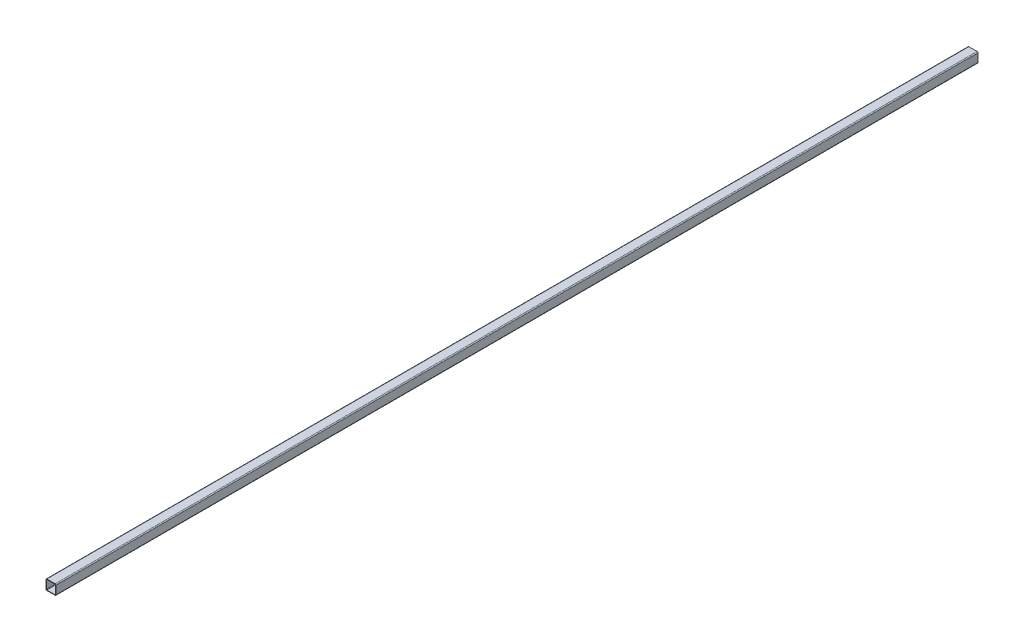
ISO-10303-21;
HEADER;
FILE_DESCRIPTION(('STEP AP214'),'2;1');
FILE_NAME('part.step','',(''),(''),'','','');
FILE_SCHEMA(('AUTOMOTIVE_DESIGN { 1 0 10303 214 1 1 1 1 }'));
ENDSEC;
DATA;
#1=APPLICATION_CONTEXT('core data for automotive mechanical design processes');
#2=APPLICATION_PROTOCOL_DEFINITION('international standard','automotive_design',2000,#1);
#3=PRODUCT_CONTEXT('',#1,'mechanical');
#4=PRODUCT('Part','Part','',(#3));
#5=PRODUCT_RELATED_PRODUCT_CATEGORY('part','',(#4));
#6=PRODUCT_DEFINITION_FORMATION('','',#4);
#7=PRODUCT_DEFINITION_CONTEXT('part definition',#1,'design');
#8=PRODUCT_DEFINITION('design','',#6,#7);
#9=PRODUCT_DEFINITION_SHAPE('','',#8);
#10=(LENGTH_UNIT() NAMED_UNIT(*) SI_UNIT(.MILLI.,.METRE.));
#11=(NAMED_UNIT(*) PLANE_ANGLE_UNIT() SI_UNIT($,.RADIAN.));
#12=(NAMED_UNIT(*) SI_UNIT($,.STERADIAN.) SOLID_ANGLE_UNIT());
#13=UNCERTAINTY_MEASURE_WITH_UNIT(LENGTH_MEASURE(1.E-05),#10,'distance_accuracy_value','');
#14=(GEOMETRIC_REPRESENTATION_CONTEXT(3) GLOBAL_UNCERTAINTY_ASSIGNED_CONTEXT((#13)) GLOBAL_UNIT_ASSIGNED_CONTEXT((#10,
#11,#12)) REPRESENTATION_CONTEXT('',''));
#15=CARTESIAN_POINT('',(0.,0.,0.));
#16=DIRECTION('',(0.,0.,1.));
#17=DIRECTION('',(1.,0.,0.));
#18=AXIS2_PLACEMENT_3D('',#15,#16,#17);
#19=CARTESIAN_POINT('',(-11.2903,-11.2903,1270.));
#20=DIRECTION('',(0.,0.,1.));
#21=DIRECTION('',(1.,0.,0.));
#22=AXIS2_PLACEMENT_3D('',#19,#20,#21);
#23=PLANE('',#22);
#24=CARTESIAN_POINT('',(-11.2903,-11.2903,1270.));
#25=DIRECTION('',(0.,0.,1.));
#26=DIRECTION('',(1.,0.,0.));
#27=AXIS2_PLACEMENT_3D('',#24,#25,#26);
#28=CIRCLE('',#27,2.54);
#29=CARTESIAN_POINT('',(-13.8303,-11.2903,1270.));
#30=VERTEX_POINT('',#29);
#31=CARTESIAN_POINT('',(-11.2903,-13.8303,1270.));
#32=VERTEX_POINT('',#31);
#33=EDGE_CURVE('E211',#30,#32,#28,.T.);
#34=ORIENTED_EDGE('',*,*,#33,.T.);
#35=DIRECTION('',(1.,0.,0.));
#36=VECTOR('',#35,1.);
#37=CARTESIAN_POINT('',(-11.2903,-13.8303,1270.));
#38=LINE('',#37,#36);
#39=CARTESIAN_POINT('',(11.2903,-13.8303,1270.));
#40=VERTEX_POINT('',#39);
#41=EDGE_CURVE('E214',#32,#40,#38,.T.);
#42=ORIENTED_EDGE('',*,*,#41,.T.);
#43=CARTESIAN_POINT('',(11.2903,-11.2903,1270.));
#44=DIRECTION('',(0.,0.,1.));
#45=DIRECTION('',(1.,0.,0.));
#46=AXIS2_PLACEMENT_3D('',#43,#44,#45);
#47=CIRCLE('',#46,2.53999999999999);
#48=CARTESIAN_POINT('',(13.8303,-11.2903,1270.));
#49=VERTEX_POINT('',#48);
#50=EDGE_CURVE('E217',#40,#49,#47,.T.);
#51=ORIENTED_EDGE('',*,*,#50,.T.);
#52=DIRECTION('',(0.,1.,0.));
#53=VECTOR('',#52,1.);
#54=CARTESIAN_POINT('',(13.8303,11.2903,1270.));
#55=LINE('',#54,#53);
#56=CARTESIAN_POINT('',(13.8303,11.2903,1270.));
#57=VERTEX_POINT('',#56);
#58=EDGE_CURVE('E219',#49,#57,#55,.T.);
#59=ORIENTED_EDGE('',*,*,#58,.T.);
#60=CARTESIAN_POINT('',(11.2903,11.2903,1270.));
#61=DIRECTION('',(0.,0.,1.));
#62=DIRECTION('',(-1.,0.,0.));
#63=AXIS2_PLACEMENT_3D('',#60,#61,#62);
#64=CIRCLE('',#63,2.53999999999999);
#65=CARTESIAN_POINT('',(11.2903,13.8303,1270.));
#66=VERTEX_POINT('',#65);
#67=EDGE_CURVE('E221',#57,#66,#64,.T.);
#68=ORIENTED_EDGE('',*,*,#67,.T.);
#69=DIRECTION('',(-1.,0.,0.));
#70=VECTOR('',#69,1.);
#71=CARTESIAN_POINT('',(-11.2903,13.8303,1270.));
#72=LINE('',#71,#70);
#73=CARTESIAN_POINT('',(-11.2903,13.8303,1270.));
#74=VERTEX_POINT('',#73);
#75=EDGE_CURVE('E223',#66,#74,#72,.T.);
#76=ORIENTED_EDGE('',*,*,#75,.T.);
#77=CARTESIAN_POINT('',(-11.2903,11.2903,1270.));
#78=DIRECTION('',(0.,0.,1.));
#79=DIRECTION('',(1.,0.,0.));
#80=AXIS2_PLACEMENT_3D('',#77,#78,#79);
#81=CIRCLE('',#80,2.54);
#82=CARTESIAN_POINT('',(-13.8303,11.2903,1270.));
#83=VERTEX_POINT('',#82);
#84=EDGE_CURVE('E225',#74,#83,#81,.T.);
#85=ORIENTED_EDGE('',*,*,#84,.T.);
#86=DIRECTION('',(0.,-1.,0.));
#87=VECTOR('',#86,1.);
#88=CARTESIAN_POINT('',(-13.8303,11.2903,1270.));
#89=LINE('',#88,#87);
#90=EDGE_CURVE('E227',#83,#30,#89,.T.);
#91=ORIENTED_EDGE('',*,*,#90,.T.);
#92=EDGE_LOOP('',(#34,#42,#51,#59,#68,#76,#85,#91));
#93=FACE_BOUND('',#92,.T.);
#94=DIRECTION('',(0.,-1.,0.));
#95=VECTOR('',#94,1.);
#96=CARTESIAN_POINT('',(-12.5603,11.2903,1270.));
#97=LINE('',#96,#95);
#98=CARTESIAN_POINT('',(-12.5603,11.2903,1270.));
#99=VERTEX_POINT('',#98);
#100=CARTESIAN_POINT('',(-12.5603,-11.2903,1270.));
#101=VERTEX_POINT('',#100);
#102=EDGE_CURVE('E154',#99,#101,#97,.T.);
#103=ORIENTED_EDGE('',*,*,#102,.F.);
#104=CARTESIAN_POINT('',(-11.2903,11.2903,1270.));
#105=DIRECTION('',(0.,0.,1.));
#106=DIRECTION('',(1.,0.,0.));
#107=AXIS2_PLACEMENT_3D('',#104,#105,#106);
#108=CIRCLE('',#107,1.27);
#109=CARTESIAN_POINT('',(-11.2903,12.5603,1270.));
#110=VERTEX_POINT('',#109);
#111=EDGE_CURVE('E146',#110,#99,#108,.T.);
#112=ORIENTED_EDGE('',*,*,#111,.F.);
#113=DIRECTION('',(-1.,0.,0.));
#114=VECTOR('',#113,1.);
#115=CARTESIAN_POINT('',(-11.2903,12.5603,1270.));
#116=LINE('',#115,#114);
#117=CARTESIAN_POINT('',(11.2903,12.5603,1270.));
#118=VERTEX_POINT('',#117);
#119=EDGE_CURVE('E179',#118,#110,#116,.T.);
#120=ORIENTED_EDGE('',*,*,#119,.F.);
#121=CARTESIAN_POINT('',(11.2903,11.2903,1270.));
#122=DIRECTION('',(0.,0.,1.));
#123=DIRECTION('',(-1.,0.,0.));
#124=AXIS2_PLACEMENT_3D('',#121,#122,#123);
#125=CIRCLE('',#124,1.26999999999999);
#126=CARTESIAN_POINT('',(12.5603,11.2903,1270.));
#127=VERTEX_POINT('',#126);
#128=EDGE_CURVE('E177',#127,#118,#125,.T.);
#129=ORIENTED_EDGE('',*,*,#128,.F.);
#130=DIRECTION('',(0.,1.,0.));
#131=VECTOR('',#130,1.);
#132=CARTESIAN_POINT('',(12.5603,11.2903,1270.));
#133=LINE('',#132,#131);
#134=CARTESIAN_POINT('',(12.5603,-11.2903,1270.));
#135=VERTEX_POINT('',#134);
#136=EDGE_CURVE('E175',#135,#127,#133,.T.);
#137=ORIENTED_EDGE('',*,*,#136,.F.);
#138=CARTESIAN_POINT('',(11.2903,-11.2903,1270.));
#139=DIRECTION('',(0.,0.,1.));
#140=DIRECTION('',(1.,0.,0.));
#141=AXIS2_PLACEMENT_3D('',#138,#139,#140);
#142=CIRCLE('',#141,1.27);
#143=CARTESIAN_POINT('',(11.2903,-12.5603,1270.));
#144=VERTEX_POINT('',#143);
#145=EDGE_CURVE('E173',#144,#135,#142,.T.);
#146=ORIENTED_EDGE('',*,*,#145,.F.);
#147=DIRECTION('',(1.,0.,0.));
#148=VECTOR('',#147,1.);
#149=CARTESIAN_POINT('',(-11.2903,-12.5603,1270.));
#150=LINE('',#149,#148);
#151=CARTESIAN_POINT('',(-11.2903,-12.5603,1270.));
#152=VERTEX_POINT('',#151);
#153=EDGE_CURVE('E169',#152,#144,#150,.T.);
#154=ORIENTED_EDGE('',*,*,#153,.F.);
#155=CARTESIAN_POINT('',(-11.2903,-11.2903,1270.));
#156=DIRECTION('',(0.,0.,1.));
#157=DIRECTION('',(1.,0.,0.));
#158=AXIS2_PLACEMENT_3D('',#155,#156,#157);
#159=CIRCLE('',#158,1.27);
#160=EDGE_CURVE('E167',#101,#152,#159,.T.);
#161=ORIENTED_EDGE('',*,*,#160,.F.);
#162=EDGE_LOOP('',(#103,#112,#120,#129,#137,#146,#154,#161));
#163=FACE_BOUND('',#162,.T.);
#164=ADVANCED_FACE('F33',(#93,#163),#23,.T.);
#165=CARTESIAN_POINT('',(-11.2903,-11.2903,-1270.));
#166=DIRECTION('',(0.,0.,1.));
#167=DIRECTION('',(1.,0.,0.));
#168=AXIS2_PLACEMENT_3D('',#165,#166,#167);
#169=PLANE('',#168);
#170=CARTESIAN_POINT('',(-11.2903,-11.2903,-1270.));
#171=DIRECTION('',(0.,0.,1.));
#172=DIRECTION('',(1.,0.,0.));
#173=AXIS2_PLACEMENT_3D('',#170,#171,#172);
#174=CIRCLE('',#173,2.54);
#175=CARTESIAN_POINT('',(-13.8303,-11.2903,-1270.));
#176=VERTEX_POINT('',#175);
#177=CARTESIAN_POINT('',(-11.2903,-13.8303,-1270.));
#178=VERTEX_POINT('',#177);
#179=EDGE_CURVE('E162',#176,#178,#174,.T.);
#180=ORIENTED_EDGE('',*,*,#179,.F.);
#181=DIRECTION('',(0.,-1.,0.));
#182=VECTOR('',#181,1.);
#183=CARTESIAN_POINT('',(-13.8303,11.2903,-1270.));
#184=LINE('',#183,#182);
#185=CARTESIAN_POINT('',(-13.8303,11.2903,-1270.));
#186=VERTEX_POINT('',#185);
#187=EDGE_CURVE('E215',#186,#176,#184,.T.);
#188=ORIENTED_EDGE('',*,*,#187,.F.);
#189=CARTESIAN_POINT('',(-11.2903,11.2903,-1270.));
#190=DIRECTION('',(0.,0.,1.));
#191=DIRECTION('',(1.,0.,0.));
#192=AXIS2_PLACEMENT_3D('',#189,#190,#191);
#193=CIRCLE('',#192,2.54);
#194=CARTESIAN_POINT('',(-11.2903,13.8303,-1270.));
#195=VERTEX_POINT('',#194);
#196=EDGE_CURVE('E242',#195,#186,#193,.T.);
#197=ORIENTED_EDGE('',*,*,#196,.F.);
#198=DIRECTION('',(-1.,0.,0.));
#199=VECTOR('',#198,1.);
#200=CARTESIAN_POINT('',(-11.2903,13.8303,-1270.));
#201=LINE('',#200,#199);
#202=CARTESIAN_POINT('',(11.2903,13.8303,-1270.));
#203=VERTEX_POINT('',#202);
#204=EDGE_CURVE('E240',#203,#195,#201,.T.);
#205=ORIENTED_EDGE('',*,*,#204,.F.);
#206=CARTESIAN_POINT('',(11.2903,11.2903,-1270.));
#207=DIRECTION('',(0.,0.,1.));
#208=DIRECTION('',(-1.,0.,0.));
#209=AXIS2_PLACEMENT_3D('',#206,#207,#208);
#210=CIRCLE('',#209,2.53999999999999);
#211=CARTESIAN_POINT('',(13.8303,11.2903,-1270.));
#212=VERTEX_POINT('',#211);
#213=EDGE_CURVE('E238',#212,#203,#210,.T.);
#214=ORIENTED_EDGE('',*,*,#213,.F.);
#215=DIRECTION('',(0.,1.,0.));
#216=VECTOR('',#215,1.);
#217=CARTESIAN_POINT('',(13.8303,11.2903,-1270.));
#218=LINE('',#217,#216);
#219=CARTESIAN_POINT('',(13.8303,-11.2903,-1270.));
#220=VERTEX_POINT('',#219);
#221=EDGE_CURVE('E236',#220,#212,#218,.T.);
#222=ORIENTED_EDGE('',*,*,#221,.F.);
#223=CARTESIAN_POINT('',(11.2903,-11.2903,-1270.));
#224=DIRECTION('',(0.,0.,1.));
#225=DIRECTION('',(1.,0.,0.));
#226=AXIS2_PLACEMENT_3D('',#223,#224,#225);
#227=CIRCLE('',#226,2.53999999999999);
#228=CARTESIAN_POINT('',(11.2903,-13.8303,-1270.));
#229=VERTEX_POINT('',#228);
#230=EDGE_CURVE('E234',#229,#220,#227,.T.);
#231=ORIENTED_EDGE('',*,*,#230,.F.);
#232=DIRECTION('',(1.,0.,0.));
#233=VECTOR('',#232,1.);
#234=CARTESIAN_POINT('',(-11.2903,-13.8303,-1270.));
#235=LINE('',#234,#233);
#236=EDGE_CURVE('E232',#178,#229,#235,.T.);
#237=ORIENTED_EDGE('',*,*,#236,.F.);
#238=EDGE_LOOP('',(#180,#188,#197,#205,#214,#222,#231,#237));
#239=FACE_BOUND('',#238,.T.);
#240=CARTESIAN_POINT('',(-11.2903,11.2903,-1270.));
#241=DIRECTION('',(0.,0.,1.));
#242=DIRECTION('',(1.,0.,0.));
#243=AXIS2_PLACEMENT_3D('',#240,#241,#242);
#244=CIRCLE('',#243,1.27);
#245=CARTESIAN_POINT('',(-11.2903,12.5603,-1270.));
#246=VERTEX_POINT('',#245);
#247=CARTESIAN_POINT('',(-12.5603,11.2903,-1270.));
#248=VERTEX_POINT('',#247);
#249=EDGE_CURVE('E56',#246,#248,#244,.T.);
#250=ORIENTED_EDGE('',*,*,#249,.T.);
#251=DIRECTION('',(0.,-1.,0.));
#252=VECTOR('',#251,1.);
#253=CARTESIAN_POINT('',(-12.5603,11.2903,-1270.));
#254=LINE('',#253,#252);
#255=CARTESIAN_POINT('',(-12.5603,-11.2903,-1270.));
#256=VERTEX_POINT('',#255);
#257=EDGE_CURVE('E161',#248,#256,#254,.T.);
#258=ORIENTED_EDGE('',*,*,#257,.T.);
#259=CARTESIAN_POINT('',(-11.2903,-11.2903,-1270.));
#260=DIRECTION('',(0.,0.,1.));
#261=DIRECTION('',(1.,0.,0.));
#262=AXIS2_PLACEMENT_3D('',#259,#260,#261);
#263=CIRCLE('',#262,1.27);
#264=CARTESIAN_POINT('',(-11.2903,-12.5603,-1270.));
#265=VERTEX_POINT('',#264);
#266=EDGE_CURVE('E183',#256,#265,#263,.T.);
#267=ORIENTED_EDGE('',*,*,#266,.T.);
#268=DIRECTION('',(1.,0.,0.));
#269=VECTOR('',#268,1.);
#270=CARTESIAN_POINT('',(-11.2903,-12.5603,-1270.));
#271=LINE('',#270,#269);
#272=CARTESIAN_POINT('',(11.2903,-12.5603,-1270.));
#273=VERTEX_POINT('',#272);
#274=EDGE_CURVE('E186',#265,#273,#271,.T.);
#275=ORIENTED_EDGE('',*,*,#274,.T.);
#276=CARTESIAN_POINT('',(11.2903,-11.2903,-1270.));
#277=DIRECTION('',(0.,0.,1.));
#278=DIRECTION('',(1.,0.,0.));
#279=AXIS2_PLACEMENT_3D('',#276,#277,#278);
#280=CIRCLE('',#279,1.27);
#281=CARTESIAN_POINT('',(12.5603,-11.2903,-1270.));
#282=VERTEX_POINT('',#281);
#283=EDGE_CURVE('E189',#273,#282,#280,.T.);
#284=ORIENTED_EDGE('',*,*,#283,.T.);
#285=DIRECTION('',(0.,1.,0.));
#286=VECTOR('',#285,1.);
#287=CARTESIAN_POINT('',(12.5603,11.2903,-1270.));
#288=LINE('',#287,#286);
#289=CARTESIAN_POINT('',(12.5603,11.2903,-1270.));
#290=VERTEX_POINT('',#289);
#291=EDGE_CURVE('E192',#282,#290,#288,.T.);
#292=ORIENTED_EDGE('',*,*,#291,.T.);
#293=CARTESIAN_POINT('',(11.2903,11.2903,-1270.));
#294=DIRECTION('',(0.,0.,1.));
#295=DIRECTION('',(-1.,0.,0.));
#296=AXIS2_PLACEMENT_3D('',#293,#294,#295);
#297=CIRCLE('',#296,1.26999999999999);
#298=CARTESIAN_POINT('',(11.2903,12.5603,-1270.));
#299=VERTEX_POINT('',#298);
#300=EDGE_CURVE('E195',#290,#299,#297,.T.);
#301=ORIENTED_EDGE('',*,*,#300,.T.);
#302=DIRECTION('',(-1.,0.,0.));
#303=VECTOR('',#302,1.);
#304=CARTESIAN_POINT('',(-11.2903,12.5603,-1270.));
#305=LINE('',#304,#303);
#306=EDGE_CURVE('E155',#299,#246,#305,.T.);
#307=ORIENTED_EDGE('',*,*,#306,.T.);
#308=EDGE_LOOP('',(#250,#258,#267,#275,#284,#292,#301,#307));
#309=FACE_BOUND('',#308,.T.);
#310=ADVANCED_FACE('F272',(#239,#309),#169,.F.);
#311=CARTESIAN_POINT('',(-11.2903,-11.2903,1270.));
#312=DIRECTION('',(0.,0.,-1.));
#313=DIRECTION('',(-1.,0.,0.));
#314=AXIS2_PLACEMENT_3D('',#311,#312,#313);
#315=CYLINDRICAL_SURFACE('',#314,2.54);
#316=ORIENTED_EDGE('',*,*,#179,.T.);
#317=DIRECTION('',(0.,0.,-1.));
#318=VECTOR('',#317,1.);
#319=CARTESIAN_POINT('',(-11.2903,-13.8303,1270.));
#320=LINE('',#319,#318);
#321=EDGE_CURVE('E11',#32,#178,#320,.T.);
#322=ORIENTED_EDGE('',*,*,#321,.F.);
#323=ORIENTED_EDGE('',*,*,#33,.F.);
#324=DIRECTION('',(0.,0.,-1.));
#325=VECTOR('',#324,1.);
#326=CARTESIAN_POINT('',(-13.8303,-11.2903,1270.));
#327=LINE('',#326,#325);
#328=EDGE_CURVE('E229',#30,#176,#327,.T.);
#329=ORIENTED_EDGE('',*,*,#328,.T.);
#330=EDGE_LOOP('',(#316,#322,#323,#329));
#331=FACE_BOUND('',#330,.T.);
#332=ADVANCED_FACE('F35',(#331),#315,.T.);
#333=CARTESIAN_POINT('',(-11.2903,-13.8303,1270.));
#334=DIRECTION('',(0.,1.,0.));
#335=DIRECTION('',(0.,0.,1.));
#336=AXIS2_PLACEMENT_3D('',#333,#334,#335);
#337=PLANE('',#336);
#338=ORIENTED_EDGE('',*,*,#236,.T.);
#339=DIRECTION('',(0.,0.,-1.));
#340=VECTOR('',#339,1.);
#341=CARTESIAN_POINT('',(11.2903,-13.8303,1270.));
#342=LINE('',#341,#340);
#343=EDGE_CURVE('E41',#40,#229,#342,.T.);
#344=ORIENTED_EDGE('',*,*,#343,.F.);
#345=ORIENTED_EDGE('',*,*,#41,.F.);
#346=ORIENTED_EDGE('',*,*,#321,.T.);
#347=EDGE_LOOP('',(#338,#344,#345,#346));
#348=FACE_BOUND('',#347,.T.);
#349=ADVANCED_FACE('F289',(#348),#337,.F.);
#350=CARTESIAN_POINT('',(11.2903,-11.2903,1270.));
#351=DIRECTION('',(0.,0.,-1.));
#352=DIRECTION('',(-1.,0.,0.));
#353=AXIS2_PLACEMENT_3D('',#350,#351,#352);
#354=CYLINDRICAL_SURFACE('',#353,2.53999999999999);
#355=ORIENTED_EDGE('',*,*,#230,.T.);
#356=DIRECTION('',(0.,0.,-1.));
#357=VECTOR('',#356,1.);
#358=CARTESIAN_POINT('',(13.8303,-11.2903,1270.));
#359=LINE('',#358,#357);
#360=EDGE_CURVE('E259',#49,#220,#359,.T.);
#361=ORIENTED_EDGE('',*,*,#360,.F.);
#362=ORIENTED_EDGE('',*,*,#50,.F.);
#363=ORIENTED_EDGE('',*,*,#343,.T.);
#364=EDGE_LOOP('',(#355,#361,#362,#363));
#365=FACE_BOUND('',#364,.T.);
#366=ADVANCED_FACE('F266',(#365),#354,.T.);
#367=CARTESIAN_POINT('',(13.8303,11.2903,1270.));
#368=DIRECTION('',(-1.,0.,0.));
#369=DIRECTION('',(0.,0.,1.));
#370=AXIS2_PLACEMENT_3D('',#367,#368,#369);
#371=PLANE('',#370);
#372=ORIENTED_EDGE('',*,*,#221,.T.);
#373=DIRECTION('',(0.,0.,-1.));
#374=VECTOR('',#373,1.);
#375=CARTESIAN_POINT('',(13.8303,11.2903,1270.));
#376=LINE('',#375,#374);
#377=EDGE_CURVE('E256',#57,#212,#376,.T.);
#378=ORIENTED_EDGE('',*,*,#377,.F.);
#379=ORIENTED_EDGE('',*,*,#58,.F.);
#380=ORIENTED_EDGE('',*,*,#360,.T.);
#381=EDGE_LOOP('',(#372,#378,#379,#380));
#382=FACE_BOUND('',#381,.T.);
#383=ADVANCED_FACE('F278',(#382),#371,.F.);
#384=CARTESIAN_POINT('',(11.2903,11.2903,1270.));
#385=DIRECTION('',(0.,0.,-1.));
#386=DIRECTION('',(-1.,0.,0.));
#387=AXIS2_PLACEMENT_3D('',#384,#385,#386);
#388=CYLINDRICAL_SURFACE('',#387,2.53999999999999);
#389=ORIENTED_EDGE('',*,*,#213,.T.);
#390=DIRECTION('',(0.,0.,-1.));
#391=VECTOR('',#390,1.);
#392=CARTESIAN_POINT('',(11.2903,13.8303,1270.));
#393=LINE('',#392,#391);
#394=EDGE_CURVE('E253',#66,#203,#393,.T.);
#395=ORIENTED_EDGE('',*,*,#394,.F.);
#396=ORIENTED_EDGE('',*,*,#67,.F.);
#397=ORIENTED_EDGE('',*,*,#377,.T.);
#398=EDGE_LOOP('',(#389,#395,#396,#397));
#399=FACE_BOUND('',#398,.T.);
#400=ADVANCED_FACE('F282',(#399),#388,.T.);
#401=CARTESIAN_POINT('',(-11.2903,13.8303,1270.));
#402=DIRECTION('',(0.,-1.,0.));
#403=DIRECTION('',(0.,0.,-1.));
#404=AXIS2_PLACEMENT_3D('',#401,#402,#403);
#405=PLANE('',#404);
#406=ORIENTED_EDGE('',*,*,#204,.T.);
#407=DIRECTION('',(0.,0.,-1.));
#408=VECTOR('',#407,1.);
#409=CARTESIAN_POINT('',(-11.2903,13.8303,1270.));
#410=LINE('',#409,#408);
#411=EDGE_CURVE('E250',#74,#195,#410,.T.);
#412=ORIENTED_EDGE('',*,*,#411,.F.);
#413=ORIENTED_EDGE('',*,*,#75,.F.);
#414=ORIENTED_EDGE('',*,*,#394,.T.);
#415=EDGE_LOOP('',(#406,#412,#413,#414));
#416=FACE_BOUND('',#415,.T.);
#417=ADVANCED_FACE('F302',(#416),#405,.F.);
#418=CARTESIAN_POINT('',(-11.2903,11.2903,1270.));
#419=DIRECTION('',(0.,0.,-1.));
#420=DIRECTION('',(-1.,0.,0.));
#421=AXIS2_PLACEMENT_3D('',#418,#419,#420);
#422=CYLINDRICAL_SURFACE('',#421,2.54);
#423=ORIENTED_EDGE('',*,*,#196,.T.);
#424=DIRECTION('',(0.,0.,-1.));
#425=VECTOR('',#424,1.);
#426=CARTESIAN_POINT('',(-13.8303,11.2903,1270.));
#427=LINE('',#426,#425);
#428=EDGE_CURVE('E247',#83,#186,#427,.T.);
#429=ORIENTED_EDGE('',*,*,#428,.F.);
#430=ORIENTED_EDGE('',*,*,#84,.F.);
#431=ORIENTED_EDGE('',*,*,#411,.T.);
#432=EDGE_LOOP('',(#423,#429,#430,#431));
#433=FACE_BOUND('',#432,.T.);
#434=ADVANCED_FACE('F300',(#433),#422,.T.);
#435=CARTESIAN_POINT('',(-13.8303,11.2903,1270.));
#436=DIRECTION('',(1.,0.,0.));
#437=DIRECTION('',(0.,0.,-1.));
#438=AXIS2_PLACEMENT_3D('',#435,#436,#437);
#439=PLANE('',#438);
#440=ORIENTED_EDGE('',*,*,#187,.T.);
#441=ORIENTED_EDGE('',*,*,#328,.F.);
#442=ORIENTED_EDGE('',*,*,#90,.F.);
#443=ORIENTED_EDGE('',*,*,#428,.T.);
#444=EDGE_LOOP('',(#440,#441,#442,#443));
#445=FACE_BOUND('',#444,.T.);
#446=ADVANCED_FACE('F295',(#445),#439,.F.);
#447=CARTESIAN_POINT('',(-11.2903,11.2903,1270.));
#448=DIRECTION('',(0.,0.,-1.));
#449=DIRECTION('',(-1.,0.,0.));
#450=AXIS2_PLACEMENT_3D('',#447,#448,#449);
#451=CYLINDRICAL_SURFACE('',#450,1.27);
#452=ORIENTED_EDGE('',*,*,#249,.F.);
#453=DIRECTION('',(0.,0.,-1.));
#454=VECTOR('',#453,1.);
#455=CARTESIAN_POINT('',(-11.2903,12.5603,1270.));
#456=LINE('',#455,#454);
#457=EDGE_CURVE('E150',#110,#246,#456,.T.);
#458=ORIENTED_EDGE('',*,*,#457,.F.);
#459=ORIENTED_EDGE('',*,*,#111,.T.);
#460=DIRECTION('',(0.,0.,-1.));
#461=VECTOR('',#460,1.);
#462=CARTESIAN_POINT('',(-12.5603,11.2903,1270.));
#463=LINE('',#462,#461);
#464=EDGE_CURVE('E149',#99,#248,#463,.T.);
#465=ORIENTED_EDGE('',*,*,#464,.T.);
#466=EDGE_LOOP('',(#452,#458,#459,#465));
#467=FACE_BOUND('',#466,.T.);
#468=ADVANCED_FACE('F148',(#467),#451,.F.);
#469=CARTESIAN_POINT('',(-12.5603,11.2903,1270.));
#470=DIRECTION('',(1.,0.,0.));
#471=DIRECTION('',(0.,0.,-1.));
#472=AXIS2_PLACEMENT_3D('',#469,#470,#471);
#473=PLANE('',#472);
#474=ORIENTED_EDGE('',*,*,#257,.F.);
#475=ORIENTED_EDGE('',*,*,#464,.F.);
#476=ORIENTED_EDGE('',*,*,#102,.T.);
#477=DIRECTION('',(0.,0.,-1.));
#478=VECTOR('',#477,1.);
#479=CARTESIAN_POINT('',(-12.5603,-11.2903,1270.));
#480=LINE('',#479,#478);
#481=EDGE_CURVE('E163',#101,#256,#480,.T.);
#482=ORIENTED_EDGE('',*,*,#481,.T.);
#483=EDGE_LOOP('',(#474,#475,#476,#482));
#484=FACE_BOUND('',#483,.T.);
#485=ADVANCED_FACE('F158',(#484),#473,.T.);
#486=CARTESIAN_POINT('',(-11.2903,-11.2903,1270.));
#487=DIRECTION('',(0.,0.,-1.));
#488=DIRECTION('',(-1.,0.,0.));
#489=AXIS2_PLACEMENT_3D('',#486,#487,#488);
#490=CYLINDRICAL_SURFACE('',#489,1.27);
#491=ORIENTED_EDGE('',*,*,#266,.F.);
#492=ORIENTED_EDGE('',*,*,#481,.F.);
#493=ORIENTED_EDGE('',*,*,#160,.T.);
#494=DIRECTION('',(0.,0.,-1.));
#495=VECTOR('',#494,1.);
#496=CARTESIAN_POINT('',(-11.2903,-12.5603,1270.));
#497=LINE('',#496,#495);
#498=EDGE_CURVE('E208',#152,#265,#497,.T.);
#499=ORIENTED_EDGE('',*,*,#498,.T.);
#500=EDGE_LOOP('',(#491,#492,#493,#499));
#501=FACE_BOUND('',#500,.T.);
#502=ADVANCED_FACE('F327',(#501),#490,.F.);
#503=CARTESIAN_POINT('',(-11.2903,-12.5603,1270.));
#504=DIRECTION('',(0.,1.,0.));
#505=DIRECTION('',(0.,0.,1.));
#506=AXIS2_PLACEMENT_3D('',#503,#504,#505);
#507=PLANE('',#506);
#508=ORIENTED_EDGE('',*,*,#274,.F.);
#509=ORIENTED_EDGE('',*,*,#498,.F.);
#510=ORIENTED_EDGE('',*,*,#153,.T.);
#511=DIRECTION('',(0.,0.,-1.));
#512=VECTOR('',#511,1.);
#513=CARTESIAN_POINT('',(11.2903,-12.5603,1270.));
#514=LINE('',#513,#512);
#515=EDGE_CURVE('E206',#144,#273,#514,.T.);
#516=ORIENTED_EDGE('',*,*,#515,.T.);
#517=EDGE_LOOP('',(#508,#509,#510,#516));
#518=FACE_BOUND('',#517,.T.);
#519=ADVANCED_FACE('F331',(#518),#507,.T.);
#520=CARTESIAN_POINT('',(11.2903,-11.2903,1270.));
#521=DIRECTION('',(0.,0.,-1.));
#522=DIRECTION('',(-1.,0.,0.));
#523=AXIS2_PLACEMENT_3D('',#520,#521,#522);
#524=CYLINDRICAL_SURFACE('',#523,1.27);
#525=ORIENTED_EDGE('',*,*,#283,.F.);
#526=ORIENTED_EDGE('',*,*,#515,.F.);
#527=ORIENTED_EDGE('',*,*,#145,.T.);
#528=DIRECTION('',(0.,0.,-1.));
#529=VECTOR('',#528,1.);
#530=CARTESIAN_POINT('',(12.5603,-11.2903,1270.));
#531=LINE('',#530,#529);
#532=EDGE_CURVE('E204',#135,#282,#531,.T.);
#533=ORIENTED_EDGE('',*,*,#532,.T.);
#534=EDGE_LOOP('',(#525,#526,#527,#533));
#535=FACE_BOUND('',#534,.T.);
#536=ADVANCED_FACE('F337',(#535),#524,.F.);
#537=CARTESIAN_POINT('',(12.5603,11.2903,1270.));
#538=DIRECTION('',(-1.,0.,0.));
#539=DIRECTION('',(0.,-1.,0.));
#540=AXIS2_PLACEMENT_3D('',#537,#538,#539);
#541=PLANE('',#540);
#542=ORIENTED_EDGE('',*,*,#291,.F.);
#543=ORIENTED_EDGE('',*,*,#532,.F.);
#544=ORIENTED_EDGE('',*,*,#136,.T.);
#545=DIRECTION('',(0.,0.,-1.));
#546=VECTOR('',#545,1.);
#547=CARTESIAN_POINT('',(12.5603,11.2903,1270.));
#548=LINE('',#547,#546);
#549=EDGE_CURVE('E202',#127,#290,#548,.T.);
#550=ORIENTED_EDGE('',*,*,#549,.T.);
#551=EDGE_LOOP('',(#542,#543,#544,#550));
#552=FACE_BOUND('',#551,.T.);
#553=ADVANCED_FACE('F341',(#552),#541,.T.);
#554=CARTESIAN_POINT('',(11.2903,11.2903,1270.));
#555=DIRECTION('',(0.,0.,-1.));
#556=DIRECTION('',(-1.,0.,0.));
#557=AXIS2_PLACEMENT_3D('',#554,#555,#556);
#558=CYLINDRICAL_SURFACE('',#557,1.26999999999999);
#559=ORIENTED_EDGE('',*,*,#300,.F.);
#560=ORIENTED_EDGE('',*,*,#549,.F.);
#561=ORIENTED_EDGE('',*,*,#128,.T.);
#562=DIRECTION('',(0.,0.,-1.));
#563=VECTOR('',#562,1.);
#564=CARTESIAN_POINT('',(11.2903,12.5603,1270.));
#565=LINE('',#564,#563);
#566=EDGE_CURVE('E48',#118,#299,#565,.T.);
#567=ORIENTED_EDGE('',*,*,#566,.T.);
#568=EDGE_LOOP('',(#559,#560,#561,#567));
#569=FACE_BOUND('',#568,.T.);
#570=ADVANCED_FACE('F345',(#569),#558,.F.);
#571=CARTESIAN_POINT('',(-11.2903,12.5603,1270.));
#572=DIRECTION('',(0.,-1.,0.));
#573=DIRECTION('',(1.,0.,0.));
#574=AXIS2_PLACEMENT_3D('',#571,#572,#573);
#575=PLANE('',#574);
#576=ORIENTED_EDGE('',*,*,#306,.F.);
#577=ORIENTED_EDGE('',*,*,#566,.F.);
#578=ORIENTED_EDGE('',*,*,#119,.T.);
#579=ORIENTED_EDGE('',*,*,#457,.T.);
#580=EDGE_LOOP('',(#576,#577,#578,#579));
#581=FACE_BOUND('',#580,.T.);
#582=ADVANCED_FACE('F349',(#581),#575,.T.);
#583=CLOSED_SHELL('',(#164,#310,#332,#349,#366,#383,#400,#417,#434,#446,#468,#485,#502,#519,
#536,#553,#570,#582));
#584=MANIFOLD_SOLID_BREP('B2',#583);
#585=ADVANCED_BREP_SHAPE_REPRESENTATION('',(#18,#584),#14);
#586=SHAPE_DEFINITION_REPRESENTATION(#9,#585);
ENDSEC;
END-ISO-10303-21;
